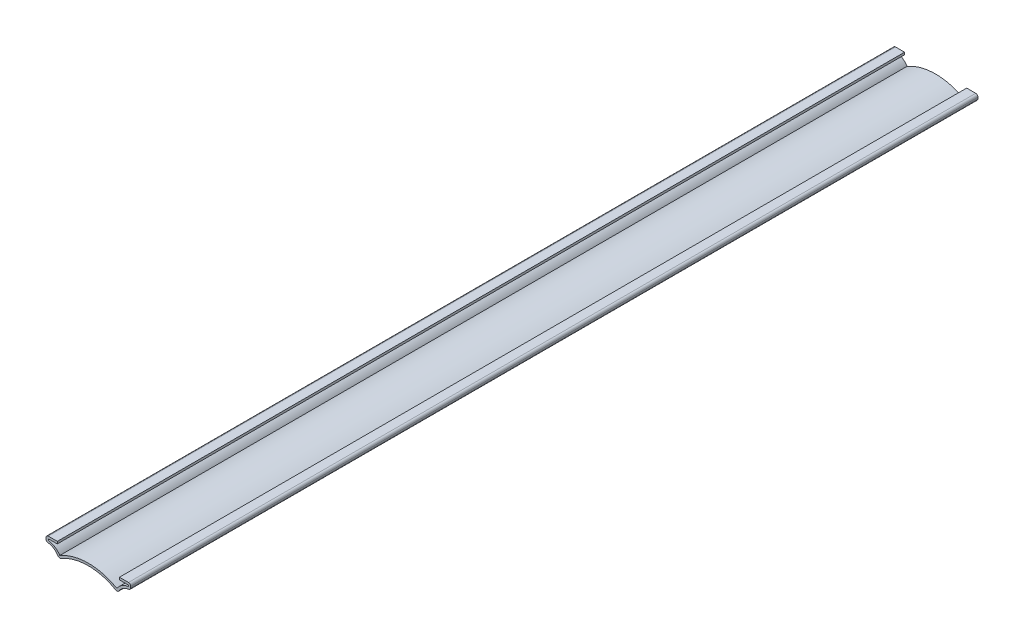
ISO-10303-21;
HEADER;
FILE_DESCRIPTION(('STEP AP214'),'2;1');
FILE_NAME('part.step','',(''),(''),'','','');
FILE_SCHEMA(('AUTOMOTIVE_DESIGN { 1 0 10303 214 1 1 1 1 }'));
ENDSEC;
DATA;
#1=APPLICATION_CONTEXT('core data for automotive mechanical design processes');
#2=APPLICATION_PROTOCOL_DEFINITION('international standard','automotive_design',2000,#1);
#3=PRODUCT_CONTEXT('',#1,'mechanical');
#4=PRODUCT('Part','Part','',(#3));
#5=PRODUCT_RELATED_PRODUCT_CATEGORY('part','',(#4));
#6=PRODUCT_DEFINITION_FORMATION('','',#4);
#7=PRODUCT_DEFINITION_CONTEXT('part definition',#1,'design');
#8=PRODUCT_DEFINITION('design','',#6,#7);
#9=PRODUCT_DEFINITION_SHAPE('','',#8);
#10=(LENGTH_UNIT() NAMED_UNIT(*) SI_UNIT(.MILLI.,.METRE.));
#11=(NAMED_UNIT(*) PLANE_ANGLE_UNIT() SI_UNIT($,.RADIAN.));
#12=(NAMED_UNIT(*) SI_UNIT($,.STERADIAN.) SOLID_ANGLE_UNIT());
#13=UNCERTAINTY_MEASURE_WITH_UNIT(LENGTH_MEASURE(1.E-05),#10,'distance_accuracy_value','');
#14=(GEOMETRIC_REPRESENTATION_CONTEXT(3) GLOBAL_UNCERTAINTY_ASSIGNED_CONTEXT((#13)) GLOBAL_UNIT_ASSIGNED_CONTEXT((#10,
#11,#12)) REPRESENTATION_CONTEXT('',''));
#15=CARTESIAN_POINT('',(0.,0.,0.));
#16=DIRECTION('',(0.,0.,1.));
#17=DIRECTION('',(1.,0.,0.));
#18=AXIS2_PLACEMENT_3D('',#15,#16,#17);
#19=CARTESIAN_POINT('',(0.,-34.1060914776614,-476.25));
#20=DIRECTION('',(0.,0.,1.));
#21=DIRECTION('',(1.,0.,0.));
#22=AXIS2_PLACEMENT_3D('',#19,#20,#21);
#23=CYLINDRICAL_SURFACE('',#22,30.95625);
#24=CARTESIAN_POINT('',(0.,-34.1060914776614,-476.25));
#25=DIRECTION('',(0.,0.,-1.));
#26=DIRECTION('',(-1.,0.,0.));
#27=AXIS2_PLACEMENT_3D('',#24,#25,#26);
#28=CIRCLE('',#27,30.95625);
#29=CARTESIAN_POINT('',(-15.4172974923681,-7.26216568253372,-476.25));
#30=VERTEX_POINT('',#29);
#31=CARTESIAN_POINT('',(15.4172974923681,-7.26216568253371,-476.25));
#32=VERTEX_POINT('',#31);
#33=EDGE_CURVE('E198',#30,#32,#28,.T.);
#34=ORIENTED_EDGE('',*,*,#33,.T.);
#35=DIRECTION('',(0.,0.,1.));
#36=VECTOR('',#35,1.);
#37=CARTESIAN_POINT('',(15.4172974923681,-7.26216568253371,-476.25));
#38=LINE('',#37,#36);
#39=CARTESIAN_POINT('',(15.4172974923681,-7.26216568253371,0.));
#40=VERTEX_POINT('',#39);
#41=EDGE_CURVE('E345',#32,#40,#38,.T.);
#42=ORIENTED_EDGE('',*,*,#41,.T.);
#43=CARTESIAN_POINT('',(0.,-34.1060914776614,0.));
#44=DIRECTION('',(0.,0.,-1.));
#45=DIRECTION('',(-1.,0.,0.));
#46=AXIS2_PLACEMENT_3D('',#43,#44,#45);
#47=CIRCLE('',#46,30.95625);
#48=CARTESIAN_POINT('',(-15.4172974923681,-7.26216568253372,0.));
#49=VERTEX_POINT('',#48);
#50=EDGE_CURVE('E251',#49,#40,#47,.T.);
#51=ORIENTED_EDGE('',*,*,#50,.F.);
#52=DIRECTION('',(0.,0.,1.));
#53=VECTOR('',#52,1.);
#54=CARTESIAN_POINT('',(-15.4172974923681,-7.26216568253373,-476.25));
#55=LINE('',#54,#53);
#56=EDGE_CURVE('E343',#49,#30,#55,.F.);
#57=ORIENTED_EDGE('',*,*,#56,.T.);
#58=EDGE_LOOP('',(#34,#42,#51,#57));
#59=FACE_BOUND('',#58,.T.);
#60=ADVANCED_FACE('F35',(#59),#23,.F.);
#61=CARTESIAN_POINT('',(-23.8125,-11.1125,-476.25));
#62=DIRECTION('',(0.,0.,1.));
#63=DIRECTION('',(1.,0.,0.));
#64=AXIS2_PLACEMENT_3D('',#61,#62,#63);
#65=CYLINDRICAL_SURFACE('',#64,7.9375);
#66=CARTESIAN_POINT('',(-23.8125,-11.1125,-476.25));
#67=DIRECTION('',(0.,0.,-1.));
#68=DIRECTION('',(-1.,0.,0.));
#69=AXIS2_PLACEMENT_3D('',#66,#67,#68);
#70=CIRCLE('',#69,7.9375);
#71=CARTESIAN_POINT('',(-22.7176724137931,-3.25086792984559,-476.25));
#72=VERTEX_POINT('',#71);
#73=CARTESIAN_POINT('',(-17.1205189697203,-6.84385898202058,-476.25));
#74=VERTEX_POINT('',#73);
#75=EDGE_CURVE('E274',#72,#74,#70,.T.);
#76=ORIENTED_EDGE('',*,*,#75,.T.);
#77=DIRECTION('',(0.,0.,1.));
#78=VECTOR('',#77,1.);
#79=CARTESIAN_POINT('',(-17.1205189697203,-6.84385898202058,-476.25));
#80=LINE('',#79,#78);
#81=CARTESIAN_POINT('',(-17.1205189697203,-6.84385898202058,0.));
#82=VERTEX_POINT('',#81);
#83=EDGE_CURVE('E350',#74,#82,#80,.T.);
#84=ORIENTED_EDGE('',*,*,#83,.T.);
#85=CARTESIAN_POINT('',(-23.8125,-11.1125,0.));
#86=DIRECTION('',(0.,0.,-1.));
#87=DIRECTION('',(-1.,0.,0.));
#88=AXIS2_PLACEMENT_3D('',#85,#86,#87);
#89=CIRCLE('',#88,7.9375);
#90=CARTESIAN_POINT('',(-22.7176724137931,-3.25086792984559,0.));
#91=VERTEX_POINT('',#90);
#92=EDGE_CURVE('E260',#91,#82,#89,.T.);
#93=ORIENTED_EDGE('',*,*,#92,.F.);
#94=DIRECTION('',(0.,0.,1.));
#95=VECTOR('',#94,1.);
#96=CARTESIAN_POINT('',(-22.7176724137931,-3.25086792984559,-476.25));
#97=LINE('',#96,#95);
#98=EDGE_CURVE('E348',#91,#72,#97,.F.);
#99=ORIENTED_EDGE('',*,*,#98,.T.);
#100=EDGE_LOOP('',(#76,#84,#93,#99));
#101=FACE_BOUND('',#100,.T.);
#102=ADVANCED_FACE('F430',(#101),#65,.F.);
#103=CARTESIAN_POINT('',(-23.8125,0.,-476.25));
#104=DIRECTION('',(-1.,0.,0.));
#105=DIRECTION('',(0.,-1.,0.));
#106=AXIS2_PLACEMENT_3D('',#103,#104,#105);
#107=PLANE('',#106);
#108=DIRECTION('',(0.,-1.,0.));
#109=VECTOR('',#108,1.);
#110=CARTESIAN_POINT('',(-23.8125,0.,-476.25));
#111=LINE('',#110,#109);
#112=CARTESIAN_POINT('',(-23.8125,-1.27,-476.25));
#113=VERTEX_POINT('',#112);
#114=CARTESIAN_POINT('',(-23.8125,-1.99300679862088,-476.25));
#115=VERTEX_POINT('',#114);
#116=EDGE_CURVE('E271',#113,#115,#111,.T.);
#117=ORIENTED_EDGE('',*,*,#116,.T.);
#118=DIRECTION('',(0.,0.,1.));
#119=VECTOR('',#118,1.);
#120=CARTESIAN_POINT('',(-23.8125,-1.99300679862088,-476.25));
#121=LINE('',#120,#119);
#122=CARTESIAN_POINT('',(-23.8125,-1.99300679862088,0.));
#123=VERTEX_POINT('',#122);
#124=EDGE_CURVE('E43',#115,#123,#121,.T.);
#125=ORIENTED_EDGE('',*,*,#124,.T.);
#126=DIRECTION('',(0.,-1.,0.));
#127=VECTOR('',#126,1.);
#128=CARTESIAN_POINT('',(-23.8125,0.,0.));
#129=LINE('',#128,#127);
#130=CARTESIAN_POINT('',(-23.8125,-1.27,0.));
#131=VERTEX_POINT('',#130);
#132=EDGE_CURVE('E292',#131,#123,#129,.T.);
#133=ORIENTED_EDGE('',*,*,#132,.F.);
#134=DIRECTION('',(0.,0.,1.));
#135=VECTOR('',#134,1.);
#136=CARTESIAN_POINT('',(-23.8125,-1.27,-476.25));
#137=LINE('',#136,#135);
#138=EDGE_CURVE('E353',#131,#113,#137,.F.);
#139=ORIENTED_EDGE('',*,*,#138,.T.);
#140=EDGE_LOOP('',(#117,#125,#133,#139));
#141=FACE_BOUND('',#140,.T.);
#142=ADVANCED_FACE('F358',(#141),#107,.T.);
#143=CARTESIAN_POINT('',(-17.4625,0.,-476.25));
#144=DIRECTION('',(0.,1.,0.));
#145=DIRECTION('',(0.,0.,1.));
#146=AXIS2_PLACEMENT_3D('',#143,#144,#145);
#147=PLANE('',#146);
#148=DIRECTION('',(-1.,0.,0.));
#149=VECTOR('',#148,1.);
#150=CARTESIAN_POINT('',(-17.4625,0.,-476.25));
#151=LINE('',#150,#149);
#152=CARTESIAN_POINT('',(-17.4625,0.,-476.25));
#153=VERTEX_POINT('',#152);
#154=CARTESIAN_POINT('',(-22.5425,0.,-476.25));
#155=VERTEX_POINT('',#154);
#156=EDGE_CURVE('E269',#153,#155,#151,.T.);
#157=ORIENTED_EDGE('',*,*,#156,.T.);
#158=DIRECTION('',(0.,0.,1.));
#159=VECTOR('',#158,1.);
#160=CARTESIAN_POINT('',(-22.5425,0.,-476.25));
#161=LINE('',#160,#159);
#162=CARTESIAN_POINT('',(-22.5425,0.,0.));
#163=VERTEX_POINT('',#162);
#164=EDGE_CURVE('E11',#155,#163,#161,.T.);
#165=ORIENTED_EDGE('',*,*,#164,.T.);
#166=DIRECTION('',(-1.,0.,0.));
#167=VECTOR('',#166,1.);
#168=CARTESIAN_POINT('',(-17.4625,0.,0.));
#169=LINE('',#168,#167);
#170=CARTESIAN_POINT('',(-17.4625,0.,0.));
#171=VERTEX_POINT('',#170);
#172=EDGE_CURVE('E289',#171,#163,#169,.T.);
#173=ORIENTED_EDGE('',*,*,#172,.F.);
#174=DIRECTION('',(0.,0.,1.));
#175=VECTOR('',#174,1.);
#176=CARTESIAN_POINT('',(-17.4625,0.,-476.25));
#177=LINE('',#176,#175);
#178=EDGE_CURVE('E297',#153,#171,#177,.T.);
#179=ORIENTED_EDGE('',*,*,#178,.F.);
#180=EDGE_LOOP('',(#157,#165,#173,#179));
#181=FACE_BOUND('',#180,.T.);
#182=ADVANCED_FACE('F371',(#181),#147,.T.);
#183=CARTESIAN_POINT('',(-17.4625,0.,-476.25));
#184=DIRECTION('',(-1.,0.,0.));
#185=DIRECTION('',(0.,0.,1.));
#186=AXIS2_PLACEMENT_3D('',#183,#184,#185);
#187=PLANE('',#186);
#188=DIRECTION('',(0.,-1.,0.));
#189=VECTOR('',#188,1.);
#190=CARTESIAN_POINT('',(-17.4625,0.,0.));
#191=LINE('',#190,#189);
#192=CARTESIAN_POINT('',(-17.4625,-1.27,0.));
#193=VERTEX_POINT('',#192);
#194=EDGE_CURVE('E287',#171,#193,#191,.T.);
#195=ORIENTED_EDGE('',*,*,#194,.T.);
#196=DIRECTION('',(0.,0.,1.));
#197=VECTOR('',#196,1.);
#198=CARTESIAN_POINT('',(-17.4625,-1.27,-476.25));
#199=LINE('',#198,#197);
#200=CARTESIAN_POINT('',(-17.4625,-1.27,-476.25));
#201=VERTEX_POINT('',#200);
#202=EDGE_CURVE('E300',#201,#193,#199,.T.);
#203=ORIENTED_EDGE('',*,*,#202,.F.);
#204=DIRECTION('',(0.,-1.,0.));
#205=VECTOR('',#204,1.);
#206=CARTESIAN_POINT('',(-17.4625,0.,-476.25));
#207=LINE('',#206,#205);
#208=EDGE_CURVE('E267',#153,#201,#207,.T.);
#209=ORIENTED_EDGE('',*,*,#208,.F.);
#210=ORIENTED_EDGE('',*,*,#178,.T.);
#211=EDGE_LOOP('',(#195,#203,#209,#210));
#212=FACE_BOUND('',#211,.T.);
#213=ADVANCED_FACE('F377',(#212),#187,.F.);
#214=CARTESIAN_POINT('',(-17.4625,-1.27,-476.25));
#215=DIRECTION('',(0.,1.,0.));
#216=DIRECTION('',(0.,0.,1.));
#217=AXIS2_PLACEMENT_3D('',#214,#215,#216);
#218=PLANE('',#217);
#219=DIRECTION('',(1.,0.,0.));
#220=VECTOR('',#219,1.);
#221=CARTESIAN_POINT('',(-17.4625,-1.27,0.));
#222=LINE('',#221,#220);
#223=CARTESIAN_POINT('',(-22.5425,-1.27,0.));
#224=VERTEX_POINT('',#223);
#225=EDGE_CURVE('E285',#193,#224,#222,.F.);
#226=ORIENTED_EDGE('',*,*,#225,.T.);
#227=DIRECTION('',(0.,0.,1.));
#228=VECTOR('',#227,1.);
#229=CARTESIAN_POINT('',(-22.5425,-1.27,-476.25));
#230=LINE('',#229,#228);
#231=CARTESIAN_POINT('',(-22.5425,-1.27,-476.25));
#232=VERTEX_POINT('',#231);
#233=EDGE_CURVE('E303',#232,#224,#230,.T.);
#234=ORIENTED_EDGE('',*,*,#233,.F.);
#235=DIRECTION('',(1.,0.,0.));
#236=VECTOR('',#235,1.);
#237=CARTESIAN_POINT('',(-17.4625,-1.27,-476.25));
#238=LINE('',#237,#236);
#239=EDGE_CURVE('E265',#201,#232,#238,.F.);
#240=ORIENTED_EDGE('',*,*,#239,.F.);
#241=ORIENTED_EDGE('',*,*,#202,.T.);
#242=EDGE_LOOP('',(#226,#234,#240,#241));
#243=FACE_BOUND('',#242,.T.);
#244=ADVANCED_FACE('F380',(#243),#218,.F.);
#245=CARTESIAN_POINT('',(-22.5425,0.,-476.25));
#246=DIRECTION('',(-1.,0.,0.));
#247=DIRECTION('',(0.,-1.,0.));
#248=AXIS2_PLACEMENT_3D('',#245,#246,#247);
#249=PLANE('',#248);
#250=DIRECTION('',(0.,-1.,0.));
#251=VECTOR('',#250,1.);
#252=CARTESIAN_POINT('',(-22.5425,0.,0.));
#253=LINE('',#252,#251);
#254=CARTESIAN_POINT('',(-22.5425,-1.99300679862088,0.));
#255=VERTEX_POINT('',#254);
#256=EDGE_CURVE('E283',#224,#255,#253,.T.);
#257=ORIENTED_EDGE('',*,*,#256,.T.);
#258=DIRECTION('',(0.,0.,1.));
#259=VECTOR('',#258,1.);
#260=CARTESIAN_POINT('',(-22.5425,-1.99300679862088,-476.25));
#261=LINE('',#260,#259);
#262=CARTESIAN_POINT('',(-22.5425,-1.99300679862088,-476.25));
#263=VERTEX_POINT('',#262);
#264=EDGE_CURVE('E306',#263,#255,#261,.T.);
#265=ORIENTED_EDGE('',*,*,#264,.F.);
#266=DIRECTION('',(0.,-1.,0.));
#267=VECTOR('',#266,1.);
#268=CARTESIAN_POINT('',(-22.5425,0.,-476.25));
#269=LINE('',#268,#267);
#270=EDGE_CURVE('E263',#232,#263,#269,.T.);
#271=ORIENTED_EDGE('',*,*,#270,.F.);
#272=ORIENTED_EDGE('',*,*,#233,.T.);
#273=EDGE_LOOP('',(#257,#265,#271,#272));
#274=FACE_BOUND('',#273,.T.);
#275=ADVANCED_FACE('F385',(#274),#249,.F.);
#276=CARTESIAN_POINT('',(-23.8125,-11.1125,-476.25));
#277=DIRECTION('',(0.,0.,1.));
#278=DIRECTION('',(1.,0.,0.));
#279=AXIS2_PLACEMENT_3D('',#276,#277,#278);
#280=CYLINDRICAL_SURFACE('',#279,9.2075);
#281=CARTESIAN_POINT('',(-23.8125,-11.1125,0.));
#282=DIRECTION('',(0.,0.,1.));
#283=DIRECTION('',(1.,0.,0.));
#284=AXIS2_PLACEMENT_3D('',#281,#282,#283);
#285=CIRCLE('',#284,9.2075);
#286=CARTESIAN_POINT('',(-16.0498020048755,-6.16087641914388,0.));
#287=VERTEX_POINT('',#286);
#288=EDGE_CURVE('E281',#255,#287,#285,.F.);
#289=ORIENTED_EDGE('',*,*,#288,.T.);
#290=DIRECTION('',(0.,0.,1.));
#291=VECTOR('',#290,1.);
#292=CARTESIAN_POINT('',(-16.0498020048755,-6.16087641914388,-476.25));
#293=LINE('',#292,#291);
#294=CARTESIAN_POINT('',(-16.0498020048755,-6.16087641914388,-476.25));
#295=VERTEX_POINT('',#294);
#296=EDGE_CURVE('E277',#295,#287,#293,.T.);
#297=ORIENTED_EDGE('',*,*,#296,.F.);
#298=CARTESIAN_POINT('',(-23.8125,-11.1125,-476.25));
#299=DIRECTION('',(0.,0.,1.));
#300=DIRECTION('',(1.,0.,0.));
#301=AXIS2_PLACEMENT_3D('',#298,#299,#300);
#302=CIRCLE('',#301,9.2075);
#303=EDGE_CURVE('E194',#263,#295,#302,.F.);
#304=ORIENTED_EDGE('',*,*,#303,.F.);
#305=ORIENTED_EDGE('',*,*,#264,.T.);
#306=EDGE_LOOP('',(#289,#297,#304,#305));
#307=FACE_BOUND('',#306,.T.);
#308=ADVANCED_FACE('F388',(#307),#280,.T.);
#309=CARTESIAN_POINT('',(0.,-34.1060914776614,-476.25));
#310=DIRECTION('',(0.,0.,1.));
#311=DIRECTION('',(1.,0.,0.));
#312=AXIS2_PLACEMENT_3D('',#309,#310,#311);
#313=CYLINDRICAL_SURFACE('',#312,32.22625);
#314=CARTESIAN_POINT('',(0.,-34.1060914776614,0.));
#315=DIRECTION('',(0.,0.,1.));
#316=DIRECTION('',(1.,0.,0.));
#317=AXIS2_PLACEMENT_3D('',#314,#315,#316);
#318=CIRCLE('',#317,32.22625);
#319=CARTESIAN_POINT('',(16.0498020048756,-6.16087641914379,0.));
#320=VERTEX_POINT('',#319);
#321=EDGE_CURVE('E204',#287,#320,#318,.F.);
#322=ORIENTED_EDGE('',*,*,#321,.T.);
#323=DIRECTION('',(0.,0.,1.));
#324=VECTOR('',#323,1.);
#325=CARTESIAN_POINT('',(16.0498020048756,-6.16087641914379,-476.25));
#326=LINE('',#325,#324);
#327=CARTESIAN_POINT('',(16.0498020048756,-6.16087641914379,-476.25));
#328=VERTEX_POINT('',#327);
#329=EDGE_CURVE('E201',#328,#320,#326,.T.);
#330=ORIENTED_EDGE('',*,*,#329,.F.);
#331=CARTESIAN_POINT('',(0.,-34.1060914776614,-476.25));
#332=DIRECTION('',(0.,0.,1.));
#333=DIRECTION('',(1.,0.,0.));
#334=AXIS2_PLACEMENT_3D('',#331,#332,#333);
#335=CIRCLE('',#334,32.22625);
#336=EDGE_CURVE('E186',#295,#328,#335,.F.);
#337=ORIENTED_EDGE('',*,*,#336,.F.);
#338=ORIENTED_EDGE('',*,*,#296,.T.);
#339=EDGE_LOOP('',(#322,#330,#337,#338));
#340=FACE_BOUND('',#339,.T.);
#341=ADVANCED_FACE('F202',(#340),#313,.T.);
#342=CARTESIAN_POINT('',(0.,-34.1060914776614,-476.25));
#343=DIRECTION('',(0.,0.,-1.));
#344=DIRECTION('',(-1.,0.,0.));
#345=AXIS2_PLACEMENT_3D('',#342,#343,#344);
#346=PLANE('',#345);
#347=DIRECTION('',(0.,-1.,0.));
#348=VECTOR('',#347,1.);
#349=CARTESIAN_POINT('',(23.8125,1.21088569284113E-13,-476.25));
#350=LINE('',#349,#348);
#351=CARTESIAN_POINT('',(23.8125,-1.26999999999988,-476.25));
#352=VERTEX_POINT('',#351);
#353=CARTESIAN_POINT('',(23.8125,-1.99300679862076,-476.25));
#354=VERTEX_POINT('',#353);
#355=EDGE_CURVE('E229',#352,#354,#350,.T.);
#356=ORIENTED_EDGE('',*,*,#355,.T.);
#357=CARTESIAN_POINT('',(22.5425,-1.99300679862077,-476.25));
#358=DIRECTION('',(0.,0.,-1.));
#359=DIRECTION('',(-1.,0.,0.));
#360=AXIS2_PLACEMENT_3D('',#357,#358,#359);
#361=CIRCLE('',#360,1.27);
#362=CARTESIAN_POINT('',(22.7176724137931,-3.25086792984547,-476.25));
#363=VERTEX_POINT('',#362);
#364=EDGE_CURVE('E340',#354,#363,#361,.T.);
#365=ORIENTED_EDGE('',*,*,#364,.T.);
#366=CARTESIAN_POINT('',(23.8125000000001,-11.1124999999999,-476.25));
#367=DIRECTION('',(0.,0.,1.));
#368=DIRECTION('',(1.,0.,0.));
#369=AXIS2_PLACEMENT_3D('',#366,#367,#368);
#370=CIRCLE('',#369,7.9375);
#371=CARTESIAN_POINT('',(17.1205189697203,-6.84385898202056,-476.25));
#372=VERTEX_POINT('',#371);
#373=EDGE_CURVE('E208',#363,#372,#370,.T.);
#374=ORIENTED_EDGE('',*,*,#373,.T.);
#375=CARTESIAN_POINT('',(16.0498020048755,-6.16087641914387,-476.25));
#376=DIRECTION('',(0.,0.,-1.));
#377=DIRECTION('',(-1.,0.,0.));
#378=AXIS2_PLACEMENT_3D('',#375,#376,#377);
#379=CIRCLE('',#378,1.27);
#380=EDGE_CURVE('E336',#372,#32,#379,.T.);
#381=ORIENTED_EDGE('',*,*,#380,.T.);
#382=ORIENTED_EDGE('',*,*,#33,.F.);
#383=CARTESIAN_POINT('',(-16.0498020048755,-6.16087641914388,-476.25));
#384=DIRECTION('',(0.,0.,-1.));
#385=DIRECTION('',(-1.,0.,0.));
#386=AXIS2_PLACEMENT_3D('',#383,#384,#385);
#387=CIRCLE('',#386,1.27);
#388=EDGE_CURVE('E334',#30,#74,#387,.T.);
#389=ORIENTED_EDGE('',*,*,#388,.T.);
#390=ORIENTED_EDGE('',*,*,#75,.F.);
#391=CARTESIAN_POINT('',(-22.5425,-1.99300679862088,-476.25));
#392=DIRECTION('',(0.,0.,-1.));
#393=DIRECTION('',(-1.,0.,0.));
#394=AXIS2_PLACEMENT_3D('',#391,#392,#393);
#395=CIRCLE('',#394,1.27);
#396=EDGE_CURVE('E332',#72,#115,#395,.T.);
#397=ORIENTED_EDGE('',*,*,#396,.T.);
#398=ORIENTED_EDGE('',*,*,#116,.F.);
#399=CARTESIAN_POINT('',(-22.5425,-1.27,-476.25));
#400=DIRECTION('',(0.,0.,-1.));
#401=DIRECTION('',(-1.,0.,0.));
#402=AXIS2_PLACEMENT_3D('',#399,#400,#401);
#403=CIRCLE('',#402,1.27);
#404=EDGE_CURVE('E58',#113,#155,#403,.T.);
#405=ORIENTED_EDGE('',*,*,#404,.T.);
#406=ORIENTED_EDGE('',*,*,#156,.F.);
#407=ORIENTED_EDGE('',*,*,#208,.T.);
#408=ORIENTED_EDGE('',*,*,#239,.T.);
#409=ORIENTED_EDGE('',*,*,#270,.T.);
#410=ORIENTED_EDGE('',*,*,#303,.T.);
#411=ORIENTED_EDGE('',*,*,#336,.T.);
#412=CARTESIAN_POINT('',(23.8125000000001,-11.1124999999999,-476.25));
#413=DIRECTION('',(0.,0.,-1.));
#414=DIRECTION('',(-1.,0.,0.));
#415=AXIS2_PLACEMENT_3D('',#412,#413,#414);
#416=CIRCLE('',#415,9.2075);
#417=CARTESIAN_POINT('',(22.5425,-1.99300679862076,-476.25));
#418=VERTEX_POINT('',#417);
#419=EDGE_CURVE('E191',#418,#328,#416,.F.);
#420=ORIENTED_EDGE('',*,*,#419,.F.);
#421=DIRECTION('',(0.,-1.,0.));
#422=VECTOR('',#421,1.);
#423=CARTESIAN_POINT('',(22.5425,1.15902642804677E-13,-476.25));
#424=LINE('',#423,#422);
#425=CARTESIAN_POINT('',(22.5425,-1.26999999999989,-476.25));
#426=VERTEX_POINT('',#425);
#427=EDGE_CURVE('E213',#426,#418,#424,.T.);
#428=ORIENTED_EDGE('',*,*,#427,.F.);
#429=DIRECTION('',(-1.,0.,0.));
#430=VECTOR('',#429,1.);
#431=CARTESIAN_POINT('',(17.4625,-1.26999999999991,-476.25));
#432=LINE('',#431,#430);
#433=CARTESIAN_POINT('',(17.4625,-1.26999999999991,-476.25));
#434=VERTEX_POINT('',#433);
#435=EDGE_CURVE('E216',#434,#426,#432,.F.);
#436=ORIENTED_EDGE('',*,*,#435,.F.);
#437=DIRECTION('',(0.,-1.,0.));
#438=VECTOR('',#437,1.);
#439=CARTESIAN_POINT('',(17.4625,0.,-476.25));
#440=LINE('',#439,#438);
#441=CARTESIAN_POINT('',(17.4625,0.,-476.25));
#442=VERTEX_POINT('',#441);
#443=EDGE_CURVE('E224',#442,#434,#440,.T.);
#444=ORIENTED_EDGE('',*,*,#443,.F.);
#445=DIRECTION('',(1.,0.,0.));
#446=VECTOR('',#445,1.);
#447=CARTESIAN_POINT('',(17.4625,0.,-476.25));
#448=LINE('',#447,#446);
#449=CARTESIAN_POINT('',(22.5425,1.14514864023895E-13,-476.25));
#450=VERTEX_POINT('',#449);
#451=EDGE_CURVE('E227',#442,#450,#448,.T.);
#452=ORIENTED_EDGE('',*,*,#451,.T.);
#453=CARTESIAN_POINT('',(22.5425,-1.26999999999989,-476.25));
#454=DIRECTION('',(0.,0.,-1.));
#455=DIRECTION('',(-1.,0.,0.));
#456=AXIS2_PLACEMENT_3D('',#453,#454,#455);
#457=CIRCLE('',#456,1.27);
#458=EDGE_CURVE('E338',#450,#352,#457,.T.);
#459=ORIENTED_EDGE('',*,*,#458,.T.);
#460=EDGE_LOOP('',(#356,#365,#374,#381,#382,#389,#390,#397,#398,#405,#406,#407,#408,#409,#410,
#411,#420,#428,#436,#444,#452,#459));
#461=FACE_BOUND('',#460,.T.);
#462=ADVANCED_FACE('F189',(#461),#346,.T.);
#463=CARTESIAN_POINT('',(0.,-34.1060914776614,0.));
#464=DIRECTION('',(0.,0.,-1.));
#465=DIRECTION('',(-1.,0.,0.));
#466=AXIS2_PLACEMENT_3D('',#463,#464,#465);
#467=PLANE('',#466);
#468=CARTESIAN_POINT('',(23.8125000000001,-11.1124999999999,0.));
#469=DIRECTION('',(0.,0.,1.));
#470=DIRECTION('',(1.,0.,0.));
#471=AXIS2_PLACEMENT_3D('',#468,#469,#470);
#472=CIRCLE('',#471,7.9375);
#473=CARTESIAN_POINT('',(22.7176724137931,-3.25086792984547,0.));
#474=VERTEX_POINT('',#473);
#475=CARTESIAN_POINT('',(17.1205189697203,-6.84385898202056,0.));
#476=VERTEX_POINT('',#475);
#477=EDGE_CURVE('E214',#474,#476,#472,.T.);
#478=ORIENTED_EDGE('',*,*,#477,.F.);
#479=CARTESIAN_POINT('',(22.5425,-1.99300679862077,0.));
#480=DIRECTION('',(0.,0.,-1.));
#481=DIRECTION('',(-1.,0.,0.));
#482=AXIS2_PLACEMENT_3D('',#479,#480,#481);
#483=CIRCLE('',#482,1.27);
#484=CARTESIAN_POINT('',(23.8125,-1.99300679862076,0.));
#485=VERTEX_POINT('',#484);
#486=EDGE_CURVE('E324',#474,#485,#483,.F.);
#487=ORIENTED_EDGE('',*,*,#486,.T.);
#488=DIRECTION('',(0.,-1.,0.));
#489=VECTOR('',#488,1.);
#490=CARTESIAN_POINT('',(23.8125,1.21088569284113E-13,0.));
#491=LINE('',#490,#489);
#492=CARTESIAN_POINT('',(23.8125,-1.26999999999988,0.));
#493=VERTEX_POINT('',#492);
#494=EDGE_CURVE('E219',#493,#485,#491,.T.);
#495=ORIENTED_EDGE('',*,*,#494,.F.);
#496=CARTESIAN_POINT('',(22.5425,-1.26999999999989,0.));
#497=DIRECTION('',(0.,0.,-1.));
#498=DIRECTION('',(-1.,0.,0.));
#499=AXIS2_PLACEMENT_3D('',#496,#497,#498);
#500=CIRCLE('',#499,1.27);
#501=CARTESIAN_POINT('',(22.5425,1.14514864023895E-13,0.));
#502=VERTEX_POINT('',#501);
#503=EDGE_CURVE('E322',#493,#502,#500,.F.);
#504=ORIENTED_EDGE('',*,*,#503,.T.);
#505=DIRECTION('',(1.,0.,0.));
#506=VECTOR('',#505,1.);
#507=CARTESIAN_POINT('',(17.4625,0.,0.));
#508=LINE('',#507,#506);
#509=CARTESIAN_POINT('',(17.4625,0.,0.));
#510=VERTEX_POINT('',#509);
#511=EDGE_CURVE('E244',#510,#502,#508,.T.);
#512=ORIENTED_EDGE('',*,*,#511,.F.);
#513=DIRECTION('',(0.,-1.,0.));
#514=VECTOR('',#513,1.);
#515=CARTESIAN_POINT('',(17.4625,0.,0.));
#516=LINE('',#515,#514);
#517=CARTESIAN_POINT('',(17.4625,-1.26999999999991,0.));
#518=VERTEX_POINT('',#517);
#519=EDGE_CURVE('E241',#510,#518,#516,.T.);
#520=ORIENTED_EDGE('',*,*,#519,.T.);
#521=DIRECTION('',(-1.,0.,0.));
#522=VECTOR('',#521,1.);
#523=CARTESIAN_POINT('',(17.4625,-1.26999999999991,0.));
#524=LINE('',#523,#522);
#525=CARTESIAN_POINT('',(22.5425,-1.26999999999989,0.));
#526=VERTEX_POINT('',#525);
#527=EDGE_CURVE('E238',#518,#526,#524,.F.);
#528=ORIENTED_EDGE('',*,*,#527,.T.);
#529=DIRECTION('',(0.,-1.,0.));
#530=VECTOR('',#529,1.);
#531=CARTESIAN_POINT('',(22.5425,1.15902642804677E-13,0.));
#532=LINE('',#531,#530);
#533=CARTESIAN_POINT('',(22.5425,-1.99300679862076,0.));
#534=VERTEX_POINT('',#533);
#535=EDGE_CURVE('E235',#526,#534,#532,.T.);
#536=ORIENTED_EDGE('',*,*,#535,.T.);
#537=CARTESIAN_POINT('',(23.8125000000001,-11.1124999999999,0.));
#538=DIRECTION('',(0.,0.,-1.));
#539=DIRECTION('',(-1.,0.,0.));
#540=AXIS2_PLACEMENT_3D('',#537,#538,#539);
#541=CIRCLE('',#540,9.2075);
#542=EDGE_CURVE('E233',#534,#320,#541,.F.);
#543=ORIENTED_EDGE('',*,*,#542,.T.);
#544=ORIENTED_EDGE('',*,*,#321,.F.);
#545=ORIENTED_EDGE('',*,*,#288,.F.);
#546=ORIENTED_EDGE('',*,*,#256,.F.);
#547=ORIENTED_EDGE('',*,*,#225,.F.);
#548=ORIENTED_EDGE('',*,*,#194,.F.);
#549=ORIENTED_EDGE('',*,*,#172,.T.);
#550=CARTESIAN_POINT('',(-22.5425,-1.27,0.));
#551=DIRECTION('',(0.,0.,-1.));
#552=DIRECTION('',(-1.,0.,0.));
#553=AXIS2_PLACEMENT_3D('',#550,#551,#552);
#554=CIRCLE('',#553,1.27);
#555=EDGE_CURVE('E314',#163,#131,#554,.F.);
#556=ORIENTED_EDGE('',*,*,#555,.T.);
#557=ORIENTED_EDGE('',*,*,#132,.T.);
#558=CARTESIAN_POINT('',(-22.5425,-1.99300679862088,0.));
#559=DIRECTION('',(0.,0.,-1.));
#560=DIRECTION('',(-1.,0.,0.));
#561=AXIS2_PLACEMENT_3D('',#558,#559,#560);
#562=CIRCLE('',#561,1.27);
#563=EDGE_CURVE('E316',#123,#91,#562,.F.);
#564=ORIENTED_EDGE('',*,*,#563,.T.);
#565=ORIENTED_EDGE('',*,*,#92,.T.);
#566=CARTESIAN_POINT('',(-16.0498020048755,-6.16087641914388,0.));
#567=DIRECTION('',(0.,0.,-1.));
#568=DIRECTION('',(-1.,0.,0.));
#569=AXIS2_PLACEMENT_3D('',#566,#567,#568);
#570=CIRCLE('',#569,1.27);
#571=EDGE_CURVE('E318',#82,#49,#570,.F.);
#572=ORIENTED_EDGE('',*,*,#571,.T.);
#573=ORIENTED_EDGE('',*,*,#50,.T.);
#574=CARTESIAN_POINT('',(16.0498020048755,-6.16087641914387,0.));
#575=DIRECTION('',(0.,0.,-1.));
#576=DIRECTION('',(-1.,0.,0.));
#577=AXIS2_PLACEMENT_3D('',#574,#575,#576);
#578=CIRCLE('',#577,1.27);
#579=EDGE_CURVE('E320',#40,#476,#578,.F.);
#580=ORIENTED_EDGE('',*,*,#579,.T.);
#581=EDGE_LOOP('',(#478,#487,#495,#504,#512,#520,#528,#536,#543,#544,#545,#546,#547,#548,#549,
#556,#557,#564,#565,#572,#573,#580));
#582=FACE_BOUND('',#581,.T.);
#583=ADVANCED_FACE('F364',(#582),#467,.F.);
#584=CARTESIAN_POINT('',(23.8125000000001,-11.1124999999999,-476.25));
#585=DIRECTION('',(0.,0.,1.));
#586=DIRECTION('',(-1.,0.,0.));
#587=AXIS2_PLACEMENT_3D('',#584,#585,#586);
#588=CYLINDRICAL_SURFACE('',#587,7.9375);
#589=ORIENTED_EDGE('',*,*,#373,.F.);
#590=DIRECTION('',(0.,0.,1.));
#591=VECTOR('',#590,1.);
#592=CARTESIAN_POINT('',(22.7176724137931,-3.25086792984547,-476.25));
#593=LINE('',#592,#591);
#594=EDGE_CURVE('E311',#363,#474,#593,.T.);
#595=ORIENTED_EDGE('',*,*,#594,.T.);
#596=ORIENTED_EDGE('',*,*,#477,.T.);
#597=DIRECTION('',(0.,0.,1.));
#598=VECTOR('',#597,1.);
#599=CARTESIAN_POINT('',(17.1205189697203,-6.84385898202056,-476.25));
#600=LINE('',#599,#598);
#601=EDGE_CURVE('E299',#476,#372,#600,.F.);
#602=ORIENTED_EDGE('',*,*,#601,.T.);
#603=EDGE_LOOP('',(#589,#595,#596,#602));
#604=FACE_BOUND('',#603,.T.);
#605=ADVANCED_FACE('F415',(#604),#588,.F.);
#606=CARTESIAN_POINT('',(23.8125,1.21088569284113E-13,-476.25));
#607=DIRECTION('',(1.,0.,0.));
#608=DIRECTION('',(0.,-1.,0.));
#609=AXIS2_PLACEMENT_3D('',#606,#607,#608);
#610=PLANE('',#609);
#611=ORIENTED_EDGE('',*,*,#494,.T.);
#612=DIRECTION('',(0.,0.,1.));
#613=VECTOR('',#612,1.);
#614=CARTESIAN_POINT('',(23.8125,-1.99300679862076,-476.25));
#615=LINE('',#614,#613);
#616=EDGE_CURVE('E329',#485,#354,#615,.F.);
#617=ORIENTED_EDGE('',*,*,#616,.T.);
#618=ORIENTED_EDGE('',*,*,#355,.F.);
#619=DIRECTION('',(0.,0.,1.));
#620=VECTOR('',#619,1.);
#621=CARTESIAN_POINT('',(23.8125,-1.26999999999988,-476.25));
#622=LINE('',#621,#620);
#623=EDGE_CURVE('E326',#352,#493,#622,.T.);
#624=ORIENTED_EDGE('',*,*,#623,.T.);
#625=EDGE_LOOP('',(#611,#617,#618,#624));
#626=FACE_BOUND('',#625,.T.);
#627=ADVANCED_FACE('F407',(#626),#610,.T.);
#628=CARTESIAN_POINT('',(17.4625,0.,-476.25));
#629=DIRECTION('',(0.,1.,0.));
#630=DIRECTION('',(0.,0.,1.));
#631=AXIS2_PLACEMENT_3D('',#628,#629,#630);
#632=PLANE('',#631);
#633=ORIENTED_EDGE('',*,*,#511,.T.);
#634=DIRECTION('',(0.,0.,1.));
#635=VECTOR('',#634,1.);
#636=CARTESIAN_POINT('',(22.5425,1.14514864023895E-13,-476.25));
#637=LINE('',#636,#635);
#638=EDGE_CURVE('E50',#502,#450,#637,.F.);
#639=ORIENTED_EDGE('',*,*,#638,.T.);
#640=ORIENTED_EDGE('',*,*,#451,.F.);
#641=DIRECTION('',(0.,0.,1.));
#642=VECTOR('',#641,1.);
#643=CARTESIAN_POINT('',(17.4625,0.,-476.25));
#644=LINE('',#643,#642);
#645=EDGE_CURVE('E248',#442,#510,#644,.T.);
#646=ORIENTED_EDGE('',*,*,#645,.T.);
#647=EDGE_LOOP('',(#633,#639,#640,#646));
#648=FACE_BOUND('',#647,.T.);
#649=ADVANCED_FACE('F399',(#648),#632,.T.);
#650=CARTESIAN_POINT('',(17.4625,0.,-476.25));
#651=DIRECTION('',(1.,0.,0.));
#652=DIRECTION('',(0.,0.,1.));
#653=AXIS2_PLACEMENT_3D('',#650,#651,#652);
#654=PLANE('',#653);
#655=ORIENTED_EDGE('',*,*,#519,.F.);
#656=ORIENTED_EDGE('',*,*,#645,.F.);
#657=ORIENTED_EDGE('',*,*,#443,.T.);
#658=DIRECTION('',(0.,0.,1.));
#659=VECTOR('',#658,1.);
#660=CARTESIAN_POINT('',(17.4625,-1.26999999999991,-476.25));
#661=LINE('',#660,#659);
#662=EDGE_CURVE('E252',#434,#518,#661,.T.);
#663=ORIENTED_EDGE('',*,*,#662,.T.);
#664=EDGE_LOOP('',(#655,#656,#657,#663));
#665=FACE_BOUND('',#664,.T.);
#666=ADVANCED_FACE('F397',(#665),#654,.F.);
#667=CARTESIAN_POINT('',(17.4625,-1.26999999999991,-476.25));
#668=DIRECTION('',(0.,1.,0.));
#669=DIRECTION('',(0.,0.,1.));
#670=AXIS2_PLACEMENT_3D('',#667,#668,#669);
#671=PLANE('',#670);
#672=ORIENTED_EDGE('',*,*,#527,.F.);
#673=ORIENTED_EDGE('',*,*,#662,.F.);
#674=ORIENTED_EDGE('',*,*,#435,.T.);
#675=DIRECTION('',(0.,0.,1.));
#676=VECTOR('',#675,1.);
#677=CARTESIAN_POINT('',(22.5425,-1.26999999999989,-476.25));
#678=LINE('',#677,#676);
#679=EDGE_CURVE('E255',#426,#526,#678,.T.);
#680=ORIENTED_EDGE('',*,*,#679,.T.);
#681=EDGE_LOOP('',(#672,#673,#674,#680));
#682=FACE_BOUND('',#681,.T.);
#683=ADVANCED_FACE('F395',(#682),#671,.F.);
#684=CARTESIAN_POINT('',(22.5425,1.15902642804677E-13,-476.25));
#685=DIRECTION('',(1.,0.,0.));
#686=DIRECTION('',(0.,-1.,0.));
#687=AXIS2_PLACEMENT_3D('',#684,#685,#686);
#688=PLANE('',#687);
#689=ORIENTED_EDGE('',*,*,#535,.F.);
#690=ORIENTED_EDGE('',*,*,#679,.F.);
#691=ORIENTED_EDGE('',*,*,#427,.T.);
#692=DIRECTION('',(0.,0.,1.));
#693=VECTOR('',#692,1.);
#694=CARTESIAN_POINT('',(22.5425,-1.99300679862076,-476.25));
#695=LINE('',#694,#693);
#696=EDGE_CURVE('E207',#418,#534,#695,.T.);
#697=ORIENTED_EDGE('',*,*,#696,.T.);
#698=EDGE_LOOP('',(#689,#690,#691,#697));
#699=FACE_BOUND('',#698,.T.);
#700=ADVANCED_FACE('F390',(#699),#688,.F.);
#701=CARTESIAN_POINT('',(23.8125000000001,-11.1124999999999,-476.25));
#702=DIRECTION('',(0.,0.,1.));
#703=DIRECTION('',(-1.,0.,0.));
#704=AXIS2_PLACEMENT_3D('',#701,#702,#703);
#705=CYLINDRICAL_SURFACE('',#704,9.2075);
#706=ORIENTED_EDGE('',*,*,#542,.F.);
#707=ORIENTED_EDGE('',*,*,#696,.F.);
#708=ORIENTED_EDGE('',*,*,#419,.T.);
#709=ORIENTED_EDGE('',*,*,#329,.T.);
#710=EDGE_LOOP('',(#706,#707,#708,#709));
#711=FACE_BOUND('',#710,.T.);
#712=ADVANCED_FACE('F210',(#711),#705,.T.);
#713=CARTESIAN_POINT('',(22.5425,-1.99300679862077,-476.25));
#714=DIRECTION('',(0.,0.,1.));
#715=DIRECTION('',(1.,0.,0.));
#716=AXIS2_PLACEMENT_3D('',#713,#714,#715);
#717=CYLINDRICAL_SURFACE('',#716,1.27);
#718=ORIENTED_EDGE('',*,*,#364,.F.);
#719=ORIENTED_EDGE('',*,*,#616,.F.);
#720=ORIENTED_EDGE('',*,*,#486,.F.);
#721=ORIENTED_EDGE('',*,*,#594,.F.);
#722=EDGE_LOOP('',(#718,#719,#720,#721));
#723=FACE_BOUND('',#722,.T.);
#724=ADVANCED_FACE('F412',(#723),#717,.T.);
#725=CARTESIAN_POINT('',(22.5425,-1.26999999999989,-476.25));
#726=DIRECTION('',(0.,0.,1.));
#727=DIRECTION('',(1.,0.,0.));
#728=AXIS2_PLACEMENT_3D('',#725,#726,#727);
#729=CYLINDRICAL_SURFACE('',#728,1.27);
#730=ORIENTED_EDGE('',*,*,#458,.F.);
#731=ORIENTED_EDGE('',*,*,#638,.F.);
#732=ORIENTED_EDGE('',*,*,#503,.F.);
#733=ORIENTED_EDGE('',*,*,#623,.F.);
#734=EDGE_LOOP('',(#730,#731,#732,#733));
#735=FACE_BOUND('',#734,.T.);
#736=ADVANCED_FACE('F404',(#735),#729,.T.);
#737=CARTESIAN_POINT('',(16.0498020048755,-6.16087641914387,-476.25));
#738=DIRECTION('',(0.,0.,1.));
#739=DIRECTION('',(1.,0.,0.));
#740=AXIS2_PLACEMENT_3D('',#737,#738,#739);
#741=CYLINDRICAL_SURFACE('',#740,1.27);
#742=ORIENTED_EDGE('',*,*,#380,.F.);
#743=ORIENTED_EDGE('',*,*,#601,.F.);
#744=ORIENTED_EDGE('',*,*,#579,.F.);
#745=ORIENTED_EDGE('',*,*,#41,.F.);
#746=EDGE_LOOP('',(#742,#743,#744,#745));
#747=FACE_BOUND('',#746,.T.);
#748=ADVANCED_FACE('F421',(#747),#741,.T.);
#749=CARTESIAN_POINT('',(-16.0498020048755,-6.16087641914388,-476.25));
#750=DIRECTION('',(0.,0.,1.));
#751=DIRECTION('',(1.,0.,0.));
#752=AXIS2_PLACEMENT_3D('',#749,#750,#751);
#753=CYLINDRICAL_SURFACE('',#752,1.27);
#754=ORIENTED_EDGE('',*,*,#388,.F.);
#755=ORIENTED_EDGE('',*,*,#56,.F.);
#756=ORIENTED_EDGE('',*,*,#571,.F.);
#757=ORIENTED_EDGE('',*,*,#83,.F.);
#758=EDGE_LOOP('',(#754,#755,#756,#757));
#759=FACE_BOUND('',#758,.T.);
#760=ADVANCED_FACE('F428',(#759),#753,.T.);
#761=CARTESIAN_POINT('',(-22.5425,-1.99300679862088,-476.25));
#762=DIRECTION('',(0.,0.,1.));
#763=DIRECTION('',(1.,0.,0.));
#764=AXIS2_PLACEMENT_3D('',#761,#762,#763);
#765=CYLINDRICAL_SURFACE('',#764,1.27);
#766=ORIENTED_EDGE('',*,*,#396,.F.);
#767=ORIENTED_EDGE('',*,*,#98,.F.);
#768=ORIENTED_EDGE('',*,*,#563,.F.);
#769=ORIENTED_EDGE('',*,*,#124,.F.);
#770=EDGE_LOOP('',(#766,#767,#768,#769));
#771=FACE_BOUND('',#770,.T.);
#772=ADVANCED_FACE('F433',(#771),#765,.T.);
#773=CARTESIAN_POINT('',(-22.5425,-1.27,-476.25));
#774=DIRECTION('',(0.,0.,1.));
#775=DIRECTION('',(1.,0.,0.));
#776=AXIS2_PLACEMENT_3D('',#773,#774,#775);
#777=CYLINDRICAL_SURFACE('',#776,1.27);
#778=ORIENTED_EDGE('',*,*,#404,.F.);
#779=ORIENTED_EDGE('',*,*,#138,.F.);
#780=ORIENTED_EDGE('',*,*,#555,.F.);
#781=ORIENTED_EDGE('',*,*,#164,.F.);
#782=EDGE_LOOP('',(#778,#779,#780,#781));
#783=FACE_BOUND('',#782,.T.);
#784=ADVANCED_FACE('F37',(#783),#777,.T.);
#785=CLOSED_SHELL('',(#60,#102,#142,#182,#213,#244,#275,#308,#341,#462,#583,#605,#627,#649,#666,
#683,#700,#712,#724,#736,#748,#760,#772,#784));
#786=MANIFOLD_SOLID_BREP('B2',#785);
#787=ADVANCED_BREP_SHAPE_REPRESENTATION('',(#18,#786),#14);
#788=SHAPE_DEFINITION_REPRESENTATION(#9,#787);
ENDSEC;
END-ISO-10303-21;
